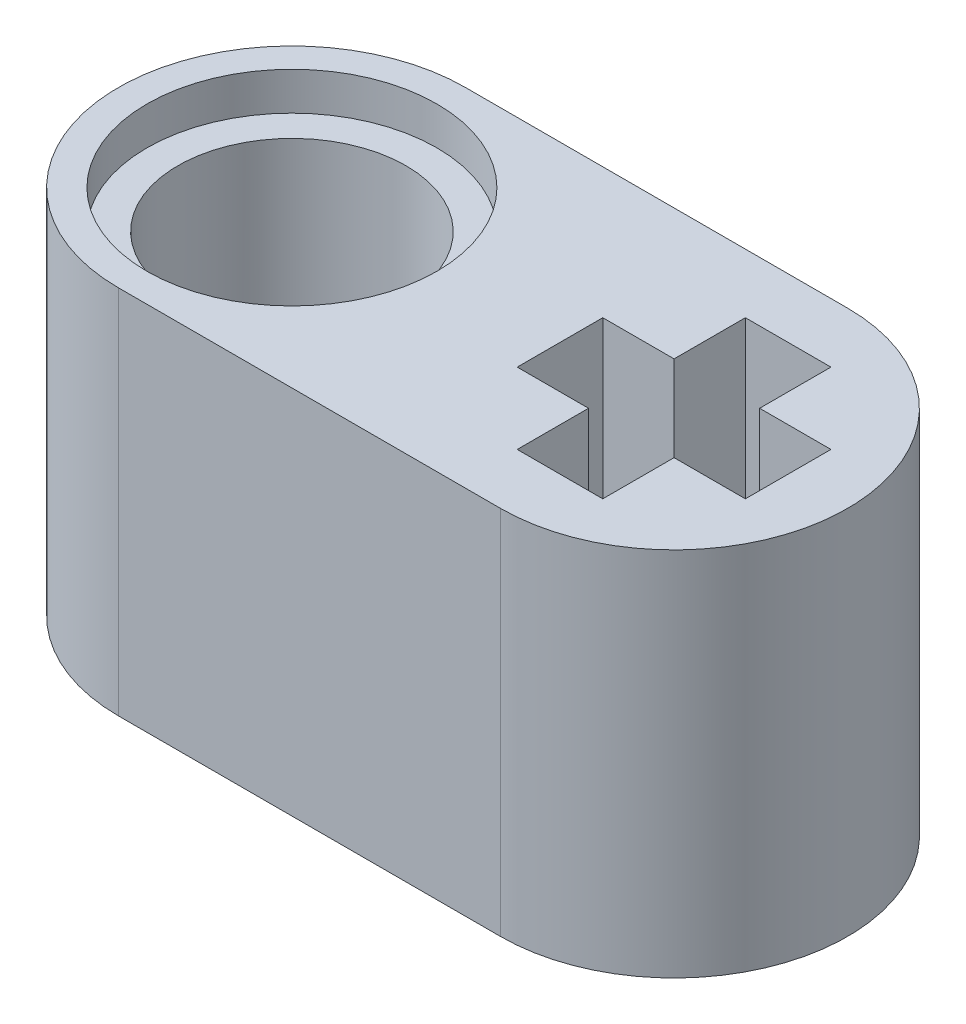
ISO-10303-21;
HEADER;
FILE_DESCRIPTION(('STEP AP214'),'2;1');
FILE_NAME('part.step','',(''),(''),'','','');
FILE_SCHEMA(('AUTOMOTIVE_DESIGN { 1 0 10303 214 1 1 1 1 }'));
ENDSEC;
DATA;
#1=APPLICATION_CONTEXT('core data for automotive mechanical design processes');
#2=APPLICATION_PROTOCOL_DEFINITION('international standard','automotive_design',2000,#1);
#3=PRODUCT_CONTEXT('',#1,'mechanical');
#4=PRODUCT('Part','Part','',(#3));
#5=PRODUCT_RELATED_PRODUCT_CATEGORY('part','',(#4));
#6=PRODUCT_DEFINITION_FORMATION('','',#4);
#7=PRODUCT_DEFINITION_CONTEXT('part definition',#1,'design');
#8=PRODUCT_DEFINITION('design','',#6,#7);
#9=PRODUCT_DEFINITION_SHAPE('','',#8);
#10=(LENGTH_UNIT() NAMED_UNIT(*) SI_UNIT(.MILLI.,.METRE.));
#11=(NAMED_UNIT(*) PLANE_ANGLE_UNIT() SI_UNIT($,.RADIAN.));
#12=(NAMED_UNIT(*) SI_UNIT($,.STERADIAN.) SOLID_ANGLE_UNIT());
#13=UNCERTAINTY_MEASURE_WITH_UNIT(LENGTH_MEASURE(1.E-05),#10,'distance_accuracy_value','');
#14=(GEOMETRIC_REPRESENTATION_CONTEXT(3) GLOBAL_UNCERTAINTY_ASSIGNED_CONTEXT((#13)) GLOBAL_UNIT_ASSIGNED_CONTEXT((#10,
#11,#12)) REPRESENTATION_CONTEXT('',''));
#15=CARTESIAN_POINT('',(0.,0.,0.));
#16=DIRECTION('',(0.,0.,1.));
#17=DIRECTION('',(1.,0.,0.));
#18=AXIS2_PLACEMENT_3D('',#15,#16,#17);
#19=CARTESIAN_POINT('',(-4.02,7.8,0.));
#20=DIRECTION('',(0.,-1.,0.));
#21=DIRECTION('',(0.,0.,-1.));
#22=AXIS2_PLACEMENT_3D('',#19,#20,#21);
#23=CYLINDRICAL_SURFACE('',#22,2.4);
#24=CARTESIAN_POINT('',(-4.02,7.,0.));
#25=DIRECTION('',(0.,1.,0.));
#26=DIRECTION('',(0.,0.,1.));
#27=AXIS2_PLACEMENT_3D('',#24,#25,#26);
#28=CIRCLE('',#27,2.4);
#29=CARTESIAN_POINT('',(-4.02,7.,2.4));
#30=VERTEX_POINT('',#29);
#31=EDGE_CURVE('E194',#30,#30,#28,.T.);
#32=ORIENTED_EDGE('',*,*,#31,.T.);
#33=EDGE_LOOP('',(#32));
#34=FACE_BOUND('',#33,.T.);
#35=CARTESIAN_POINT('',(-4.02,0.8,0.));
#36=DIRECTION('',(0.,-1.,0.));
#37=DIRECTION('',(0.,0.,-1.));
#38=AXIS2_PLACEMENT_3D('',#35,#36,#37);
#39=CIRCLE('',#38,2.4);
#40=CARTESIAN_POINT('',(-4.02,0.8,-2.4));
#41=VERTEX_POINT('',#40);
#42=EDGE_CURVE('E37',#41,#41,#39,.T.);
#43=ORIENTED_EDGE('',*,*,#42,.T.);
#44=EDGE_LOOP('',(#43));
#45=FACE_BOUND('',#44,.T.);
#46=ADVANCED_FACE('F33',(#34,#45),#23,.F.);
#47=CARTESIAN_POINT('',(-4.02,7.8,0.));
#48=DIRECTION('',(0.,1.,0.));
#49=DIRECTION('',(0.,0.,1.));
#50=AXIS2_PLACEMENT_3D('',#47,#48,#49);
#51=PLANE('',#50);
#52=CARTESIAN_POINT('',(-4.02,7.8,0.));
#53=DIRECTION('',(0.,1.,0.));
#54=DIRECTION('',(0.,0.,1.));
#55=AXIS2_PLACEMENT_3D('',#52,#53,#54);
#56=CIRCLE('',#55,3.05);
#57=CARTESIAN_POINT('',(-4.02,7.8,3.05));
#58=VERTEX_POINT('',#57);
#59=EDGE_CURVE('E273',#58,#58,#56,.T.);
#60=ORIENTED_EDGE('',*,*,#59,.F.);
#61=EDGE_LOOP('',(#60));
#62=FACE_BOUND('',#61,.T.);
#63=CARTESIAN_POINT('',(-4.02,7.8,0.));
#64=DIRECTION('',(0.,1.,0.));
#65=DIRECTION('',(0.,0.,1.));
#66=AXIS2_PLACEMENT_3D('',#63,#64,#65);
#67=CIRCLE('',#66,3.65);
#68=CARTESIAN_POINT('',(-4.02,7.8,-3.65));
#69=VERTEX_POINT('',#68);
#70=CARTESIAN_POINT('',(-4.02,7.8,3.65));
#71=VERTEX_POINT('',#70);
#72=EDGE_CURVE('E244',#69,#71,#67,.T.);
#73=ORIENTED_EDGE('',*,*,#72,.T.);
#74=DIRECTION('',(1.,0.,0.));
#75=VECTOR('',#74,1.);
#76=CARTESIAN_POINT('',(-4.02,7.8,3.65));
#77=LINE('',#76,#75);
#78=CARTESIAN_POINT('',(4.02,7.8,3.65));
#79=VERTEX_POINT('',#78);
#80=EDGE_CURVE('E247',#71,#79,#77,.T.);
#81=ORIENTED_EDGE('',*,*,#80,.T.);
#82=CARTESIAN_POINT('',(4.02,7.8,0.));
#83=DIRECTION('',(0.,1.,0.));
#84=DIRECTION('',(0.,0.,1.));
#85=AXIS2_PLACEMENT_3D('',#82,#83,#84);
#86=CIRCLE('',#85,3.65);
#87=CARTESIAN_POINT('',(4.02,7.8,-3.65));
#88=VERTEX_POINT('',#87);
#89=EDGE_CURVE('E250',#79,#88,#86,.T.);
#90=ORIENTED_EDGE('',*,*,#89,.T.);
#91=DIRECTION('',(-1.,0.,0.));
#92=VECTOR('',#91,1.);
#93=CARTESIAN_POINT('',(-4.02,7.8,-3.65));
#94=LINE('',#93,#92);
#95=EDGE_CURVE('E252',#88,#69,#94,.T.);
#96=ORIENTED_EDGE('',*,*,#95,.T.);
#97=EDGE_LOOP('',(#73,#81,#90,#96));
#98=FACE_BOUND('',#97,.T.);
#99=DIRECTION('',(1.,0.,0.));
#100=VECTOR('',#99,1.);
#101=CARTESIAN_POINT('',(6.42,7.8,0.9));
#102=LINE('',#101,#100);
#103=CARTESIAN_POINT('',(4.92,7.8,0.900000000000001));
#104=VERTEX_POINT('',#103);
#105=CARTESIAN_POINT('',(6.42,7.8,0.9));
#106=VERTEX_POINT('',#105);
#107=EDGE_CURVE('E156',#104,#106,#102,.T.);
#108=ORIENTED_EDGE('',*,*,#107,.F.);
#109=DIRECTION('',(0.,0.,-1.));
#110=VECTOR('',#109,1.);
#111=CARTESIAN_POINT('',(4.92,7.8,0.900000000000001));
#112=LINE('',#111,#110);
#113=CARTESIAN_POINT('',(4.92,7.8,2.4));
#114=VERTEX_POINT('',#113);
#115=EDGE_CURVE('E148',#114,#104,#112,.T.);
#116=ORIENTED_EDGE('',*,*,#115,.F.);
#117=DIRECTION('',(1.,0.,0.));
#118=VECTOR('',#117,1.);
#119=CARTESIAN_POINT('',(3.12,7.8,2.4));
#120=LINE('',#119,#118);
#121=CARTESIAN_POINT('',(3.12,7.8,2.4));
#122=VERTEX_POINT('',#121);
#123=EDGE_CURVE('E191',#122,#114,#120,.T.);
#124=ORIENTED_EDGE('',*,*,#123,.F.);
#125=DIRECTION('',(0.,0.,1.));
#126=VECTOR('',#125,1.);
#127=CARTESIAN_POINT('',(3.12,7.8,0.900000000000001));
#128=LINE('',#127,#126);
#129=CARTESIAN_POINT('',(3.12,7.8,0.900000000000001));
#130=VERTEX_POINT('',#129);
#131=EDGE_CURVE('E189',#130,#122,#128,.T.);
#132=ORIENTED_EDGE('',*,*,#131,.F.);
#133=DIRECTION('',(1.,0.,0.));
#134=VECTOR('',#133,1.);
#135=CARTESIAN_POINT('',(3.12,7.8,0.900000000000001));
#136=LINE('',#135,#134);
#137=CARTESIAN_POINT('',(1.62,7.8,0.900000000000001));
#138=VERTEX_POINT('',#137);
#139=EDGE_CURVE('E187',#138,#130,#136,.T.);
#140=ORIENTED_EDGE('',*,*,#139,.F.);
#141=DIRECTION('',(0.,0.,1.));
#142=VECTOR('',#141,1.);
#143=CARTESIAN_POINT('',(1.62,7.8,0.900000000000001));
#144=LINE('',#143,#142);
#145=CARTESIAN_POINT('',(1.62,7.8,-0.899999999999997));
#146=VERTEX_POINT('',#145);
#147=EDGE_CURVE('E185',#146,#138,#144,.T.);
#148=ORIENTED_EDGE('',*,*,#147,.F.);
#149=DIRECTION('',(-1.,0.,0.));
#150=VECTOR('',#149,1.);
#151=CARTESIAN_POINT('',(3.12,7.8,-0.899999999999998));
#152=LINE('',#151,#150);
#153=CARTESIAN_POINT('',(3.12,7.8,-0.899999999999998));
#154=VERTEX_POINT('',#153);
#155=EDGE_CURVE('E183',#154,#146,#152,.T.);
#156=ORIENTED_EDGE('',*,*,#155,.F.);
#157=DIRECTION('',(0.,0.,1.));
#158=VECTOR('',#157,1.);
#159=CARTESIAN_POINT('',(3.12,7.8,-2.4));
#160=LINE('',#159,#158);
#161=CARTESIAN_POINT('',(3.12,7.8,-2.4));
#162=VERTEX_POINT('',#161);
#163=EDGE_CURVE('E181',#162,#154,#160,.T.);
#164=ORIENTED_EDGE('',*,*,#163,.F.);
#165=DIRECTION('',(-1.,0.,0.));
#166=VECTOR('',#165,1.);
#167=CARTESIAN_POINT('',(3.12,7.8,-2.4));
#168=LINE('',#167,#166);
#169=CARTESIAN_POINT('',(4.92,7.8,-2.4));
#170=VERTEX_POINT('',#169);
#171=EDGE_CURVE('E179',#170,#162,#168,.T.);
#172=ORIENTED_EDGE('',*,*,#171,.F.);
#173=DIRECTION('',(0.,0.,-1.));
#174=VECTOR('',#173,1.);
#175=CARTESIAN_POINT('',(4.92,7.8,-2.4));
#176=LINE('',#175,#174);
#177=CARTESIAN_POINT('',(4.92,7.8,-0.899999999999999));
#178=VERTEX_POINT('',#177);
#179=EDGE_CURVE('E177',#178,#170,#176,.T.);
#180=ORIENTED_EDGE('',*,*,#179,.F.);
#181=DIRECTION('',(-1.,0.,0.));
#182=VECTOR('',#181,1.);
#183=CARTESIAN_POINT('',(6.42,7.8,-0.9));
#184=LINE('',#183,#182);
#185=CARTESIAN_POINT('',(6.42,7.8,-0.9));
#186=VERTEX_POINT('',#185);
#187=EDGE_CURVE('E172',#186,#178,#184,.T.);
#188=ORIENTED_EDGE('',*,*,#187,.F.);
#189=DIRECTION('',(0.,0.,-1.));
#190=VECTOR('',#189,1.);
#191=CARTESIAN_POINT('',(6.42,7.8,0.9));
#192=LINE('',#191,#190);
#193=EDGE_CURVE('E170',#106,#186,#192,.T.);
#194=ORIENTED_EDGE('',*,*,#193,.F.);
#195=EDGE_LOOP('',(#108,#116,#124,#132,#140,#148,#156,#164,#172,#180,#188,#194));
#196=FACE_BOUND('',#195,.T.);
#197=ADVANCED_FACE('F168',(#62,#98,#196),#51,.T.);
#198=CARTESIAN_POINT('',(-4.02,0.,0.));
#199=DIRECTION('',(0.,1.,0.));
#200=DIRECTION('',(0.,0.,1.));
#201=AXIS2_PLACEMENT_3D('',#198,#199,#200);
#202=PLANE('',#201);
#203=CARTESIAN_POINT('',(-4.02,0.,0.));
#204=DIRECTION('',(0.,-1.,0.));
#205=DIRECTION('',(0.,0.,-1.));
#206=AXIS2_PLACEMENT_3D('',#203,#204,#205);
#207=CIRCLE('',#206,3.05);
#208=CARTESIAN_POINT('',(-4.02,0.,-3.05));
#209=VERTEX_POINT('',#208);
#210=EDGE_CURVE('E279',#209,#209,#207,.T.);
#211=ORIENTED_EDGE('',*,*,#210,.F.);
#212=EDGE_LOOP('',(#211));
#213=FACE_BOUND('',#212,.T.);
#214=CARTESIAN_POINT('',(-4.02,0.,0.));
#215=DIRECTION('',(0.,1.,0.));
#216=DIRECTION('',(0.,0.,1.));
#217=AXIS2_PLACEMENT_3D('',#214,#215,#216);
#218=CIRCLE('',#217,3.65);
#219=CARTESIAN_POINT('',(-4.02,0.,-3.65));
#220=VERTEX_POINT('',#219);
#221=CARTESIAN_POINT('',(-4.02,0.,3.65));
#222=VERTEX_POINT('',#221);
#223=EDGE_CURVE('E164',#220,#222,#218,.T.);
#224=ORIENTED_EDGE('',*,*,#223,.F.);
#225=DIRECTION('',(-1.,0.,0.));
#226=VECTOR('',#225,1.);
#227=CARTESIAN_POINT('',(-4.02,0.,-3.65));
#228=LINE('',#227,#226);
#229=CARTESIAN_POINT('',(4.02,0.,-3.65));
#230=VERTEX_POINT('',#229);
#231=EDGE_CURVE('E248',#230,#220,#228,.T.);
#232=ORIENTED_EDGE('',*,*,#231,.F.);
#233=CARTESIAN_POINT('',(4.02,0.,0.));
#234=DIRECTION('',(0.,1.,0.));
#235=DIRECTION('',(0.,0.,1.));
#236=AXIS2_PLACEMENT_3D('',#233,#234,#235);
#237=CIRCLE('',#236,3.65);
#238=CARTESIAN_POINT('',(4.02,0.,3.65));
#239=VERTEX_POINT('',#238);
#240=EDGE_CURVE('E259',#239,#230,#237,.T.);
#241=ORIENTED_EDGE('',*,*,#240,.F.);
#242=DIRECTION('',(1.,0.,0.));
#243=VECTOR('',#242,1.);
#244=CARTESIAN_POINT('',(-4.02,0.,3.65));
#245=LINE('',#244,#243);
#246=EDGE_CURVE('E257',#222,#239,#245,.T.);
#247=ORIENTED_EDGE('',*,*,#246,.F.);
#248=EDGE_LOOP('',(#224,#232,#241,#247));
#249=FACE_BOUND('',#248,.T.);
#250=DIRECTION('',(0.,0.,-1.));
#251=VECTOR('',#250,1.);
#252=CARTESIAN_POINT('',(4.92,0.,0.900000000000001));
#253=LINE('',#252,#251);
#254=CARTESIAN_POINT('',(4.92,0.,2.4));
#255=VERTEX_POINT('',#254);
#256=CARTESIAN_POINT('',(4.92,0.,0.900000000000001));
#257=VERTEX_POINT('',#256);
#258=EDGE_CURVE('E58',#255,#257,#253,.T.);
#259=ORIENTED_EDGE('',*,*,#258,.T.);
#260=DIRECTION('',(1.,0.,0.));
#261=VECTOR('',#260,1.);
#262=CARTESIAN_POINT('',(6.42,0.,0.9));
#263=LINE('',#262,#261);
#264=CARTESIAN_POINT('',(6.42,0.,0.9));
#265=VERTEX_POINT('',#264);
#266=EDGE_CURVE('E163',#257,#265,#263,.T.);
#267=ORIENTED_EDGE('',*,*,#266,.T.);
#268=DIRECTION('',(0.,0.,-1.));
#269=VECTOR('',#268,1.);
#270=CARTESIAN_POINT('',(6.42,0.,0.9));
#271=LINE('',#270,#269);
#272=CARTESIAN_POINT('',(6.42,0.,-0.9));
#273=VERTEX_POINT('',#272);
#274=EDGE_CURVE('E196',#265,#273,#271,.T.);
#275=ORIENTED_EDGE('',*,*,#274,.T.);
#276=DIRECTION('',(-1.,0.,0.));
#277=VECTOR('',#276,1.);
#278=CARTESIAN_POINT('',(6.42,0.,-0.9));
#279=LINE('',#278,#277);
#280=CARTESIAN_POINT('',(4.92,0.,-0.899999999999999));
#281=VERTEX_POINT('',#280);
#282=EDGE_CURVE('E199',#273,#281,#279,.T.);
#283=ORIENTED_EDGE('',*,*,#282,.T.);
#284=DIRECTION('',(0.,0.,-1.));
#285=VECTOR('',#284,1.);
#286=CARTESIAN_POINT('',(4.92,0.,-2.4));
#287=LINE('',#286,#285);
#288=CARTESIAN_POINT('',(4.92,0.,-2.4));
#289=VERTEX_POINT('',#288);
#290=EDGE_CURVE('E202',#281,#289,#287,.T.);
#291=ORIENTED_EDGE('',*,*,#290,.T.);
#292=DIRECTION('',(-1.,0.,0.));
#293=VECTOR('',#292,1.);
#294=CARTESIAN_POINT('',(3.12,0.,-2.4));
#295=LINE('',#294,#293);
#296=CARTESIAN_POINT('',(3.12,0.,-2.4));
#297=VERTEX_POINT('',#296);
#298=EDGE_CURVE('E205',#289,#297,#295,.T.);
#299=ORIENTED_EDGE('',*,*,#298,.T.);
#300=DIRECTION('',(0.,0.,1.));
#301=VECTOR('',#300,1.);
#302=CARTESIAN_POINT('',(3.12,0.,-2.4));
#303=LINE('',#302,#301);
#304=CARTESIAN_POINT('',(3.12,0.,-0.899999999999998));
#305=VERTEX_POINT('',#304);
#306=EDGE_CURVE('E208',#297,#305,#303,.T.);
#307=ORIENTED_EDGE('',*,*,#306,.T.);
#308=DIRECTION('',(-1.,0.,0.));
#309=VECTOR('',#308,1.);
#310=CARTESIAN_POINT('',(3.12,0.,-0.899999999999998));
#311=LINE('',#310,#309);
#312=CARTESIAN_POINT('',(1.62,0.,-0.899999999999997));
#313=VERTEX_POINT('',#312);
#314=EDGE_CURVE('E211',#305,#313,#311,.T.);
#315=ORIENTED_EDGE('',*,*,#314,.T.);
#316=DIRECTION('',(0.,0.,1.));
#317=VECTOR('',#316,1.);
#318=CARTESIAN_POINT('',(1.62,0.,0.900000000000001));
#319=LINE('',#318,#317);
#320=CARTESIAN_POINT('',(1.62,0.,0.900000000000001));
#321=VERTEX_POINT('',#320);
#322=EDGE_CURVE('E214',#313,#321,#319,.T.);
#323=ORIENTED_EDGE('',*,*,#322,.T.);
#324=DIRECTION('',(1.,0.,0.));
#325=VECTOR('',#324,1.);
#326=CARTESIAN_POINT('',(3.12,0.,0.900000000000001));
#327=LINE('',#326,#325);
#328=CARTESIAN_POINT('',(3.12,0.,0.900000000000001));
#329=VERTEX_POINT('',#328);
#330=EDGE_CURVE('E217',#321,#329,#327,.T.);
#331=ORIENTED_EDGE('',*,*,#330,.T.);
#332=DIRECTION('',(0.,0.,1.));
#333=VECTOR('',#332,1.);
#334=CARTESIAN_POINT('',(3.12,0.,0.900000000000001));
#335=LINE('',#334,#333);
#336=CARTESIAN_POINT('',(3.12,0.,2.4));
#337=VERTEX_POINT('',#336);
#338=EDGE_CURVE('E220',#329,#337,#335,.T.);
#339=ORIENTED_EDGE('',*,*,#338,.T.);
#340=DIRECTION('',(1.,0.,0.));
#341=VECTOR('',#340,1.);
#342=CARTESIAN_POINT('',(3.12,0.,2.4));
#343=LINE('',#342,#341);
#344=EDGE_CURVE('E157',#337,#255,#343,.T.);
#345=ORIENTED_EDGE('',*,*,#344,.T.);
#346=EDGE_LOOP('',(#259,#267,#275,#283,#291,#299,#307,#315,#323,#331,#339,#345));
#347=FACE_BOUND('',#346,.T.);
#348=ADVANCED_FACE('F305',(#213,#249,#347),#202,.F.);
#349=CARTESIAN_POINT('',(-4.02,7.8,0.));
#350=DIRECTION('',(0.,-1.,0.));
#351=DIRECTION('',(0.,0.,-1.));
#352=AXIS2_PLACEMENT_3D('',#349,#350,#351);
#353=CYLINDRICAL_SURFACE('',#352,3.65);
#354=ORIENTED_EDGE('',*,*,#223,.T.);
#355=DIRECTION('',(0.,-1.,0.));
#356=VECTOR('',#355,1.);
#357=CARTESIAN_POINT('',(-4.02,7.8,3.65));
#358=LINE('',#357,#356);
#359=EDGE_CURVE('E11',#71,#222,#358,.T.);
#360=ORIENTED_EDGE('',*,*,#359,.F.);
#361=ORIENTED_EDGE('',*,*,#72,.F.);
#362=DIRECTION('',(0.,-1.,0.));
#363=VECTOR('',#362,1.);
#364=CARTESIAN_POINT('',(-4.02,7.8,-3.65));
#365=LINE('',#364,#363);
#366=EDGE_CURVE('E254',#69,#220,#365,.T.);
#367=ORIENTED_EDGE('',*,*,#366,.T.);
#368=EDGE_LOOP('',(#354,#360,#361,#367));
#369=FACE_BOUND('',#368,.T.);
#370=ADVANCED_FACE('F35',(#369),#353,.T.);
#371=CARTESIAN_POINT('',(-4.02,7.8,3.65));
#372=DIRECTION('',(0.,0.,-1.));
#373=DIRECTION('',(-1.,0.,0.));
#374=AXIS2_PLACEMENT_3D('',#371,#372,#373);
#375=PLANE('',#374);
#376=ORIENTED_EDGE('',*,*,#246,.T.);
#377=DIRECTION('',(0.,-1.,0.));
#378=VECTOR('',#377,1.);
#379=CARTESIAN_POINT('',(4.02,7.8,3.65));
#380=LINE('',#379,#378);
#381=EDGE_CURVE('E42',#79,#239,#380,.T.);
#382=ORIENTED_EDGE('',*,*,#381,.F.);
#383=ORIENTED_EDGE('',*,*,#80,.F.);
#384=ORIENTED_EDGE('',*,*,#359,.T.);
#385=EDGE_LOOP('',(#376,#382,#383,#384));
#386=FACE_BOUND('',#385,.T.);
#387=ADVANCED_FACE('F320',(#386),#375,.F.);
#388=CARTESIAN_POINT('',(4.02,7.8,0.));
#389=DIRECTION('',(0.,-1.,0.));
#390=DIRECTION('',(0.,0.,-1.));
#391=AXIS2_PLACEMENT_3D('',#388,#389,#390);
#392=CYLINDRICAL_SURFACE('',#391,3.65);
#393=ORIENTED_EDGE('',*,*,#240,.T.);
#394=DIRECTION('',(0.,-1.,0.));
#395=VECTOR('',#394,1.);
#396=CARTESIAN_POINT('',(4.02,7.8,-3.65));
#397=LINE('',#396,#395);
#398=EDGE_CURVE('E264',#88,#230,#397,.T.);
#399=ORIENTED_EDGE('',*,*,#398,.F.);
#400=ORIENTED_EDGE('',*,*,#89,.F.);
#401=ORIENTED_EDGE('',*,*,#381,.T.);
#402=EDGE_LOOP('',(#393,#399,#400,#401));
#403=FACE_BOUND('',#402,.T.);
#404=ADVANCED_FACE('F317',(#403),#392,.T.);
#405=CARTESIAN_POINT('',(-4.02,7.8,-3.65));
#406=DIRECTION('',(0.,0.,1.));
#407=DIRECTION('',(1.,0.,0.));
#408=AXIS2_PLACEMENT_3D('',#405,#406,#407);
#409=PLANE('',#408);
#410=ORIENTED_EDGE('',*,*,#231,.T.);
#411=ORIENTED_EDGE('',*,*,#366,.F.);
#412=ORIENTED_EDGE('',*,*,#95,.F.);
#413=ORIENTED_EDGE('',*,*,#398,.T.);
#414=EDGE_LOOP('',(#410,#411,#412,#413));
#415=FACE_BOUND('',#414,.T.);
#416=ADVANCED_FACE('F314',(#415),#409,.F.);
#417=CARTESIAN_POINT('',(4.92,7.8,0.900000000000001));
#418=DIRECTION('',(-1.,0.,0.));
#419=DIRECTION('',(0.,0.,1.));
#420=AXIS2_PLACEMENT_3D('',#417,#418,#419);
#421=PLANE('',#420);
#422=ORIENTED_EDGE('',*,*,#258,.F.);
#423=DIRECTION('',(0.,-1.,0.));
#424=VECTOR('',#423,1.);
#425=CARTESIAN_POINT('',(4.92,7.8,2.4));
#426=LINE('',#425,#424);
#427=EDGE_CURVE('E152',#114,#255,#426,.T.);
#428=ORIENTED_EDGE('',*,*,#427,.F.);
#429=ORIENTED_EDGE('',*,*,#115,.T.);
#430=DIRECTION('',(0.,-1.,0.));
#431=VECTOR('',#430,1.);
#432=CARTESIAN_POINT('',(4.92,7.8,0.900000000000001));
#433=LINE('',#432,#431);
#434=EDGE_CURVE('E151',#104,#257,#433,.T.);
#435=ORIENTED_EDGE('',*,*,#434,.T.);
#436=EDGE_LOOP('',(#422,#428,#429,#435));
#437=FACE_BOUND('',#436,.T.);
#438=ADVANCED_FACE('F150',(#437),#421,.T.);
#439=CARTESIAN_POINT('',(6.42,7.8,0.9));
#440=DIRECTION('',(0.,0.,-1.));
#441=DIRECTION('',(-1.,0.,0.));
#442=AXIS2_PLACEMENT_3D('',#439,#440,#441);
#443=PLANE('',#442);
#444=ORIENTED_EDGE('',*,*,#266,.F.);
#445=ORIENTED_EDGE('',*,*,#434,.F.);
#446=ORIENTED_EDGE('',*,*,#107,.T.);
#447=DIRECTION('',(0.,-1.,0.));
#448=VECTOR('',#447,1.);
#449=CARTESIAN_POINT('',(6.42,7.8,0.9));
#450=LINE('',#449,#448);
#451=EDGE_CURVE('E165',#106,#265,#450,.T.);
#452=ORIENTED_EDGE('',*,*,#451,.T.);
#453=EDGE_LOOP('',(#444,#445,#446,#452));
#454=FACE_BOUND('',#453,.T.);
#455=ADVANCED_FACE('F160',(#454),#443,.T.);
#456=CARTESIAN_POINT('',(6.42,7.8,0.9));
#457=DIRECTION('',(-1.,0.,0.));
#458=DIRECTION('',(0.,0.,1.));
#459=AXIS2_PLACEMENT_3D('',#456,#457,#458);
#460=PLANE('',#459);
#461=ORIENTED_EDGE('',*,*,#274,.F.);
#462=ORIENTED_EDGE('',*,*,#451,.F.);
#463=ORIENTED_EDGE('',*,*,#193,.T.);
#464=DIRECTION('',(0.,-1.,0.));
#465=VECTOR('',#464,1.);
#466=CARTESIAN_POINT('',(6.42,7.8,-0.9));
#467=LINE('',#466,#465);
#468=EDGE_CURVE('E241',#186,#273,#467,.T.);
#469=ORIENTED_EDGE('',*,*,#468,.T.);
#470=EDGE_LOOP('',(#461,#462,#463,#469));
#471=FACE_BOUND('',#470,.T.);
#472=ADVANCED_FACE('F383',(#471),#460,.T.);
#473=CARTESIAN_POINT('',(6.42,7.8,-0.9));
#474=DIRECTION('',(0.,0.,1.));
#475=DIRECTION('',(1.,0.,0.));
#476=AXIS2_PLACEMENT_3D('',#473,#474,#475);
#477=PLANE('',#476);
#478=ORIENTED_EDGE('',*,*,#282,.F.);
#479=ORIENTED_EDGE('',*,*,#468,.F.);
#480=ORIENTED_EDGE('',*,*,#187,.T.);
#481=DIRECTION('',(0.,-1.,0.));
#482=VECTOR('',#481,1.);
#483=CARTESIAN_POINT('',(4.92,7.8,-0.899999999999999));
#484=LINE('',#483,#482);
#485=EDGE_CURVE('E239',#178,#281,#484,.T.);
#486=ORIENTED_EDGE('',*,*,#485,.T.);
#487=EDGE_LOOP('',(#478,#479,#480,#486));
#488=FACE_BOUND('',#487,.T.);
#489=ADVANCED_FACE('F379',(#488),#477,.T.);
#490=CARTESIAN_POINT('',(4.92,7.8,-2.4));
#491=DIRECTION('',(-1.,0.,0.));
#492=DIRECTION('',(0.,0.,1.));
#493=AXIS2_PLACEMENT_3D('',#490,#491,#492);
#494=PLANE('',#493);
#495=ORIENTED_EDGE('',*,*,#290,.F.);
#496=ORIENTED_EDGE('',*,*,#485,.F.);
#497=ORIENTED_EDGE('',*,*,#179,.T.);
#498=DIRECTION('',(0.,-1.,0.));
#499=VECTOR('',#498,1.);
#500=CARTESIAN_POINT('',(4.92,7.8,-2.4));
#501=LINE('',#500,#499);
#502=EDGE_CURVE('E237',#170,#289,#501,.T.);
#503=ORIENTED_EDGE('',*,*,#502,.T.);
#504=EDGE_LOOP('',(#495,#496,#497,#503));
#505=FACE_BOUND('',#504,.T.);
#506=ADVANCED_FACE('F376',(#505),#494,.T.);
#507=CARTESIAN_POINT('',(3.12,7.8,-2.4));
#508=DIRECTION('',(0.,0.,1.));
#509=DIRECTION('',(1.,0.,0.));
#510=AXIS2_PLACEMENT_3D('',#507,#508,#509);
#511=PLANE('',#510);
#512=ORIENTED_EDGE('',*,*,#298,.F.);
#513=ORIENTED_EDGE('',*,*,#502,.F.);
#514=ORIENTED_EDGE('',*,*,#171,.T.);
#515=DIRECTION('',(0.,-1.,0.));
#516=VECTOR('',#515,1.);
#517=CARTESIAN_POINT('',(3.12,7.8,-2.4));
#518=LINE('',#517,#516);
#519=EDGE_CURVE('E235',#162,#297,#518,.T.);
#520=ORIENTED_EDGE('',*,*,#519,.T.);
#521=EDGE_LOOP('',(#512,#513,#514,#520));
#522=FACE_BOUND('',#521,.T.);
#523=ADVANCED_FACE('F370',(#522),#511,.T.);
#524=CARTESIAN_POINT('',(3.12,7.8,-2.4));
#525=DIRECTION('',(1.,0.,0.));
#526=DIRECTION('',(0.,0.,-1.));
#527=AXIS2_PLACEMENT_3D('',#524,#525,#526);
#528=PLANE('',#527);
#529=ORIENTED_EDGE('',*,*,#306,.F.);
#530=ORIENTED_EDGE('',*,*,#519,.F.);
#531=ORIENTED_EDGE('',*,*,#163,.T.);
#532=DIRECTION('',(0.,-1.,0.));
#533=VECTOR('',#532,1.);
#534=CARTESIAN_POINT('',(3.12,7.8,-0.899999999999998));
#535=LINE('',#534,#533);
#536=EDGE_CURVE('E233',#154,#305,#535,.T.);
#537=ORIENTED_EDGE('',*,*,#536,.T.);
#538=EDGE_LOOP('',(#529,#530,#531,#537));
#539=FACE_BOUND('',#538,.T.);
#540=ADVANCED_FACE('F366',(#539),#528,.T.);
#541=CARTESIAN_POINT('',(3.12,7.8,-0.899999999999998));
#542=DIRECTION('',(0.,0.,1.));
#543=DIRECTION('',(1.,0.,0.));
#544=AXIS2_PLACEMENT_3D('',#541,#542,#543);
#545=PLANE('',#544);
#546=ORIENTED_EDGE('',*,*,#314,.F.);
#547=ORIENTED_EDGE('',*,*,#536,.F.);
#548=ORIENTED_EDGE('',*,*,#155,.T.);
#549=DIRECTION('',(0.,-1.,0.));
#550=VECTOR('',#549,1.);
#551=CARTESIAN_POINT('',(1.62,7.8,-0.899999999999997));
#552=LINE('',#551,#550);
#553=EDGE_CURVE('E231',#146,#313,#552,.T.);
#554=ORIENTED_EDGE('',*,*,#553,.T.);
#555=EDGE_LOOP('',(#546,#547,#548,#554));
#556=FACE_BOUND('',#555,.T.);
#557=ADVANCED_FACE('F363',(#556),#545,.T.);
#558=CARTESIAN_POINT('',(1.62,7.8,0.900000000000001));
#559=DIRECTION('',(1.,0.,0.));
#560=DIRECTION('',(0.,0.,-1.));
#561=AXIS2_PLACEMENT_3D('',#558,#559,#560);
#562=PLANE('',#561);
#563=ORIENTED_EDGE('',*,*,#322,.F.);
#564=ORIENTED_EDGE('',*,*,#553,.F.);
#565=ORIENTED_EDGE('',*,*,#147,.T.);
#566=DIRECTION('',(0.,-1.,0.));
#567=VECTOR('',#566,1.);
#568=CARTESIAN_POINT('',(1.62,7.8,0.900000000000001));
#569=LINE('',#568,#567);
#570=EDGE_CURVE('E229',#138,#321,#569,.T.);
#571=ORIENTED_EDGE('',*,*,#570,.T.);
#572=EDGE_LOOP('',(#563,#564,#565,#571));
#573=FACE_BOUND('',#572,.T.);
#574=ADVANCED_FACE('F355',(#573),#562,.T.);
#575=CARTESIAN_POINT('',(3.12,7.8,0.900000000000001));
#576=DIRECTION('',(0.,0.,-1.));
#577=DIRECTION('',(-1.,0.,0.));
#578=AXIS2_PLACEMENT_3D('',#575,#576,#577);
#579=PLANE('',#578);
#580=ORIENTED_EDGE('',*,*,#330,.F.);
#581=ORIENTED_EDGE('',*,*,#570,.F.);
#582=ORIENTED_EDGE('',*,*,#139,.T.);
#583=DIRECTION('',(0.,-1.,0.));
#584=VECTOR('',#583,1.);
#585=CARTESIAN_POINT('',(3.12,7.8,0.900000000000001));
#586=LINE('',#585,#584);
#587=EDGE_CURVE('E227',#130,#329,#586,.T.);
#588=ORIENTED_EDGE('',*,*,#587,.T.);
#589=EDGE_LOOP('',(#580,#581,#582,#588));
#590=FACE_BOUND('',#589,.T.);
#591=ADVANCED_FACE('F351',(#590),#579,.T.);
#592=CARTESIAN_POINT('',(3.12,7.8,0.900000000000001));
#593=DIRECTION('',(1.,0.,0.));
#594=DIRECTION('',(0.,0.,-1.));
#595=AXIS2_PLACEMENT_3D('',#592,#593,#594);
#596=PLANE('',#595);
#597=ORIENTED_EDGE('',*,*,#338,.F.);
#598=ORIENTED_EDGE('',*,*,#587,.F.);
#599=ORIENTED_EDGE('',*,*,#131,.T.);
#600=DIRECTION('',(0.,-1.,0.));
#601=VECTOR('',#600,1.);
#602=CARTESIAN_POINT('',(3.12,7.8,2.4));
#603=LINE('',#602,#601);
#604=EDGE_CURVE('E50',#122,#337,#603,.T.);
#605=ORIENTED_EDGE('',*,*,#604,.T.);
#606=EDGE_LOOP('',(#597,#598,#599,#605));
#607=FACE_BOUND('',#606,.T.);
#608=ADVANCED_FACE('F348',(#607),#596,.T.);
#609=CARTESIAN_POINT('',(3.12,7.8,2.4));
#610=DIRECTION('',(0.,0.,-1.));
#611=DIRECTION('',(-1.,0.,0.));
#612=AXIS2_PLACEMENT_3D('',#609,#610,#611);
#613=PLANE('',#612);
#614=ORIENTED_EDGE('',*,*,#344,.F.);
#615=ORIENTED_EDGE('',*,*,#604,.F.);
#616=ORIENTED_EDGE('',*,*,#123,.T.);
#617=ORIENTED_EDGE('',*,*,#427,.T.);
#618=EDGE_LOOP('',(#614,#615,#616,#617));
#619=FACE_BOUND('',#618,.T.);
#620=ADVANCED_FACE('F342',(#619),#613,.T.);
#621=CARTESIAN_POINT('',(-4.02,7.,0.));
#622=DIRECTION('',(0.,1.,0.));
#623=DIRECTION('',(0.,0.,1.));
#624=AXIS2_PLACEMENT_3D('',#621,#622,#623);
#625=CYLINDRICAL_SURFACE('',#624,3.05);
#626=CARTESIAN_POINT('',(-4.02,7.,0.));
#627=DIRECTION('',(0.,1.,0.));
#628=DIRECTION('',(0.,0.,1.));
#629=AXIS2_PLACEMENT_3D('',#626,#627,#628);
#630=CIRCLE('',#629,3.05);
#631=CARTESIAN_POINT('',(-4.02,7.,3.05));
#632=VERTEX_POINT('',#631);
#633=EDGE_CURVE('E269',#632,#632,#630,.T.);
#634=ORIENTED_EDGE('',*,*,#633,.F.);
#635=EDGE_LOOP('',(#634));
#636=FACE_BOUND('',#635,.T.);
#637=ORIENTED_EDGE('',*,*,#59,.T.);
#638=EDGE_LOOP('',(#637));
#639=FACE_BOUND('',#638,.T.);
#640=ADVANCED_FACE('F408',(#636,#639),#625,.F.);
#641=CARTESIAN_POINT('',(-4.02,7.,0.));
#642=DIRECTION('',(0.,1.,0.));
#643=DIRECTION('',(0.,0.,1.));
#644=AXIS2_PLACEMENT_3D('',#641,#642,#643);
#645=PLANE('',#644);
#646=ORIENTED_EDGE('',*,*,#31,.F.);
#647=EDGE_LOOP('',(#646));
#648=FACE_BOUND('',#647,.T.);
#649=ORIENTED_EDGE('',*,*,#633,.T.);
#650=EDGE_LOOP('',(#649));
#651=FACE_BOUND('',#650,.T.);
#652=ADVANCED_FACE('F297',(#648,#651),#645,.T.);
#653=CARTESIAN_POINT('',(-4.02,0.8,0.));
#654=DIRECTION('',(0.,-1.,0.));
#655=DIRECTION('',(0.,0.,-1.));
#656=AXIS2_PLACEMENT_3D('',#653,#654,#655);
#657=CYLINDRICAL_SURFACE('',#656,3.05);
#658=CARTESIAN_POINT('',(-4.02,0.8,0.));
#659=DIRECTION('',(0.,-1.,0.));
#660=DIRECTION('',(0.,0.,-1.));
#661=AXIS2_PLACEMENT_3D('',#658,#659,#660);
#662=CIRCLE('',#661,3.05);
#663=CARTESIAN_POINT('',(-4.02,0.8,-3.05));
#664=VERTEX_POINT('',#663);
#665=EDGE_CURVE('E282',#664,#664,#662,.T.);
#666=ORIENTED_EDGE('',*,*,#665,.F.);
#667=EDGE_LOOP('',(#666));
#668=FACE_BOUND('',#667,.T.);
#669=ORIENTED_EDGE('',*,*,#210,.T.);
#670=EDGE_LOOP('',(#669));
#671=FACE_BOUND('',#670,.T.);
#672=ADVANCED_FACE('F292',(#668,#671),#657,.F.);
#673=CARTESIAN_POINT('',(-4.02,0.8,0.));
#674=DIRECTION('',(0.,-1.,0.));
#675=DIRECTION('',(0.,0.,-1.));
#676=AXIS2_PLACEMENT_3D('',#673,#674,#675);
#677=PLANE('',#676);
#678=ORIENTED_EDGE('',*,*,#42,.F.);
#679=EDGE_LOOP('',(#678));
#680=FACE_BOUND('',#679,.T.);
#681=ORIENTED_EDGE('',*,*,#665,.T.);
#682=EDGE_LOOP('',(#681));
#683=FACE_BOUND('',#682,.T.);
#684=ADVANCED_FACE('F290',(#680,#683),#677,.T.);
#685=CLOSED_SHELL('',(#46,#197,#348,#370,#387,#404,#416,#438,#455,#472,#489,#506,#523,#540,#557,
#574,#591,#608,#620,#640,#652,#672,#684));
#686=MANIFOLD_SOLID_BREP('B2',#685);
#687=ADVANCED_BREP_SHAPE_REPRESENTATION('',(#18,#686),#14);
#688=SHAPE_DEFINITION_REPRESENTATION(#9,#687);
ENDSEC;
END-ISO-10303-21;
